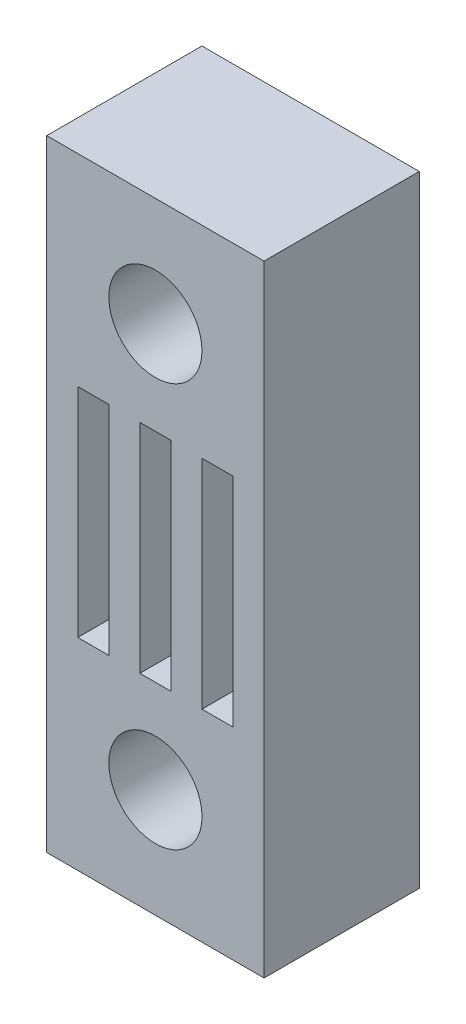
ISO-10303-21;
HEADER;
FILE_DESCRIPTION(('STEP AP214'),'2;1');
FILE_NAME('part.step','',(''),(''),'','','');
FILE_SCHEMA(('AUTOMOTIVE_DESIGN { 1 0 10303 214 1 1 1 1 }'));
ENDSEC;
DATA;
#1=APPLICATION_CONTEXT('core data for automotive mechanical design processes');
#2=APPLICATION_PROTOCOL_DEFINITION('international standard','automotive_design',2000,#1);
#3=PRODUCT_CONTEXT('',#1,'mechanical');
#4=PRODUCT('Part','Part','',(#3));
#5=PRODUCT_RELATED_PRODUCT_CATEGORY('part','',(#4));
#6=PRODUCT_DEFINITION_FORMATION('','',#4);
#7=PRODUCT_DEFINITION_CONTEXT('part definition',#1,'design');
#8=PRODUCT_DEFINITION('design','',#6,#7);
#9=PRODUCT_DEFINITION_SHAPE('','',#8);
#10=(LENGTH_UNIT() NAMED_UNIT(*) SI_UNIT(.MILLI.,.METRE.));
#11=(NAMED_UNIT(*) PLANE_ANGLE_UNIT() SI_UNIT($,.RADIAN.));
#12=(NAMED_UNIT(*) SI_UNIT($,.STERADIAN.) SOLID_ANGLE_UNIT());
#13=UNCERTAINTY_MEASURE_WITH_UNIT(LENGTH_MEASURE(1.E-05),#10,'distance_accuracy_value','');
#14=(GEOMETRIC_REPRESENTATION_CONTEXT(3) GLOBAL_UNCERTAINTY_ASSIGNED_CONTEXT((#13)) GLOBAL_UNIT_ASSIGNED_CONTEXT((#10,
#11,#12)) REPRESENTATION_CONTEXT('',''));
#15=CARTESIAN_POINT('',(0.,0.,0.));
#16=DIRECTION('',(0.,0.,1.));
#17=DIRECTION('',(1.,0.,0.));
#18=AXIS2_PLACEMENT_3D('',#15,#16,#17);
#19=CARTESIAN_POINT('',(0.,20.,5.));
#20=DIRECTION('',(0.,0.,-1.));
#21=DIRECTION('',(-1.,0.,0.));
#22=AXIS2_PLACEMENT_3D('',#19,#20,#21);
#23=PLANE('',#22);
#24=DIRECTION('',(-1.,0.,0.));
#25=VECTOR('',#24,1.);
#26=CARTESIAN_POINT('',(5.,13.5,5.));
#27=LINE('',#26,#25);
#28=CARTESIAN_POINT('',(6.,13.5,5.));
#29=VERTEX_POINT('',#28);
#30=CARTESIAN_POINT('',(5.,13.5,5.));
#31=VERTEX_POINT('',#30);
#32=EDGE_CURVE('E143',#29,#31,#27,.T.);
#33=ORIENTED_EDGE('',*,*,#32,.F.);
#34=DIRECTION('',(0.,1.,0.));
#35=VECTOR('',#34,1.);
#36=CARTESIAN_POINT('',(6.,13.5,5.));
#37=LINE('',#36,#35);
#38=CARTESIAN_POINT('',(6.,6.5,5.));
#39=VERTEX_POINT('',#38);
#40=EDGE_CURVE('E166',#39,#29,#37,.T.);
#41=ORIENTED_EDGE('',*,*,#40,.F.);
#42=DIRECTION('',(1.,0.,0.));
#43=VECTOR('',#42,1.);
#44=CARTESIAN_POINT('',(5.,6.5,5.));
#45=LINE('',#44,#43);
#46=CARTESIAN_POINT('',(5.,6.5,5.));
#47=VERTEX_POINT('',#46);
#48=EDGE_CURVE('E164',#47,#39,#45,.T.);
#49=ORIENTED_EDGE('',*,*,#48,.F.);
#50=DIRECTION('',(0.,-1.,0.));
#51=VECTOR('',#50,1.);
#52=CARTESIAN_POINT('',(5.,6.5,5.));
#53=LINE('',#52,#51);
#54=EDGE_CURVE('E151',#31,#47,#53,.T.);
#55=ORIENTED_EDGE('',*,*,#54,.F.);
#56=EDGE_LOOP('',(#33,#41,#49,#55));
#57=FACE_BOUND('',#56,.T.);
#58=DIRECTION('',(-1.,0.,0.));
#59=VECTOR('',#58,1.);
#60=CARTESIAN_POINT('',(1.,13.5,5.));
#61=LINE('',#60,#59);
#62=CARTESIAN_POINT('',(2.,13.5,5.));
#63=VERTEX_POINT('',#62);
#64=CARTESIAN_POINT('',(1.,13.5,5.));
#65=VERTEX_POINT('',#64);
#66=EDGE_CURVE('E213',#63,#65,#61,.T.);
#67=ORIENTED_EDGE('',*,*,#66,.F.);
#68=DIRECTION('',(0.,1.,0.));
#69=VECTOR('',#68,1.);
#70=CARTESIAN_POINT('',(2.,13.5,5.));
#71=LINE('',#70,#69);
#72=CARTESIAN_POINT('',(2.,6.5,5.));
#73=VERTEX_POINT('',#72);
#74=EDGE_CURVE('E221',#73,#63,#71,.T.);
#75=ORIENTED_EDGE('',*,*,#74,.F.);
#76=DIRECTION('',(1.,0.,0.));
#77=VECTOR('',#76,1.);
#78=CARTESIAN_POINT('',(1.,6.5,5.));
#79=LINE('',#78,#77);
#80=CARTESIAN_POINT('',(1.,6.5,5.));
#81=VERTEX_POINT('',#80);
#82=EDGE_CURVE('E218',#81,#73,#79,.T.);
#83=ORIENTED_EDGE('',*,*,#82,.F.);
#84=DIRECTION('',(0.,-1.,0.));
#85=VECTOR('',#84,1.);
#86=CARTESIAN_POINT('',(1.,6.5,5.));
#87=LINE('',#86,#85);
#88=EDGE_CURVE('E215',#65,#81,#87,.T.);
#89=ORIENTED_EDGE('',*,*,#88,.F.);
#90=EDGE_LOOP('',(#67,#75,#83,#89));
#91=FACE_BOUND('',#90,.T.);
#92=DIRECTION('',(0.,-1.,0.));
#93=VECTOR('',#92,1.);
#94=CARTESIAN_POINT('',(0.,0.,5.));
#95=LINE('',#94,#93);
#96=CARTESIAN_POINT('',(0.,20.,5.));
#97=VERTEX_POINT('',#96);
#98=CARTESIAN_POINT('',(0.,0.,5.));
#99=VERTEX_POINT('',#98);
#100=EDGE_CURVE('E250',#97,#99,#95,.T.);
#101=ORIENTED_EDGE('',*,*,#100,.T.);
#102=DIRECTION('',(1.,0.,0.));
#103=VECTOR('',#102,1.);
#104=CARTESIAN_POINT('',(0.,0.,5.));
#105=LINE('',#104,#103);
#106=CARTESIAN_POINT('',(7.,0.,5.));
#107=VERTEX_POINT('',#106);
#108=EDGE_CURVE('E253',#99,#107,#105,.T.);
#109=ORIENTED_EDGE('',*,*,#108,.T.);
#110=DIRECTION('',(0.,1.,0.));
#111=VECTOR('',#110,1.);
#112=CARTESIAN_POINT('',(7.,0.,5.));
#113=LINE('',#112,#111);
#114=CARTESIAN_POINT('',(6.99999999999999,20.,5.));
#115=VERTEX_POINT('',#114);
#116=EDGE_CURVE('E256',#107,#115,#113,.T.);
#117=ORIENTED_EDGE('',*,*,#116,.T.);
#118=DIRECTION('',(-1.,0.,0.));
#119=VECTOR('',#118,1.);
#120=CARTESIAN_POINT('',(0.,20.,5.));
#121=LINE('',#120,#119);
#122=EDGE_CURVE('E258',#115,#97,#121,.T.);
#123=ORIENTED_EDGE('',*,*,#122,.T.);
#124=EDGE_LOOP('',(#101,#109,#117,#123));
#125=FACE_BOUND('',#124,.T.);
#126=CARTESIAN_POINT('',(3.5,16.5,5.));
#127=DIRECTION('',(0.,0.,1.));
#128=DIRECTION('',(1.,0.,0.));
#129=AXIS2_PLACEMENT_3D('',#126,#127,#128);
#130=CIRCLE('',#129,1.5);
#131=CARTESIAN_POINT('',(5.,16.5,5.));
#132=VERTEX_POINT('',#131);
#133=EDGE_CURVE('E244',#132,#132,#130,.T.);
#134=ORIENTED_EDGE('',*,*,#133,.F.);
#135=EDGE_LOOP('',(#134));
#136=FACE_BOUND('',#135,.T.);
#137=DIRECTION('',(-1.,0.,0.));
#138=VECTOR('',#137,1.);
#139=CARTESIAN_POINT('',(3.,13.5,5.));
#140=LINE('',#139,#138);
#141=CARTESIAN_POINT('',(4.,13.5,5.));
#142=VERTEX_POINT('',#141);
#143=CARTESIAN_POINT('',(3.,13.5,5.));
#144=VERTEX_POINT('',#143);
#145=EDGE_CURVE('E182',#142,#144,#140,.T.);
#146=ORIENTED_EDGE('',*,*,#145,.F.);
#147=DIRECTION('',(0.,1.,0.));
#148=VECTOR('',#147,1.);
#149=CARTESIAN_POINT('',(4.,13.5,5.));
#150=LINE('',#149,#148);
#151=CARTESIAN_POINT('',(4.,6.5,5.));
#152=VERTEX_POINT('',#151);
#153=EDGE_CURVE('E190',#152,#142,#150,.T.);
#154=ORIENTED_EDGE('',*,*,#153,.F.);
#155=DIRECTION('',(1.,0.,0.));
#156=VECTOR('',#155,1.);
#157=CARTESIAN_POINT('',(3.,6.5,5.));
#158=LINE('',#157,#156);
#159=CARTESIAN_POINT('',(3.,6.5,5.));
#160=VERTEX_POINT('',#159);
#161=EDGE_CURVE('E187',#160,#152,#158,.T.);
#162=ORIENTED_EDGE('',*,*,#161,.F.);
#163=DIRECTION('',(0.,-1.,0.));
#164=VECTOR('',#163,1.);
#165=CARTESIAN_POINT('',(3.,6.5,5.));
#166=LINE('',#165,#164);
#167=EDGE_CURVE('E184',#144,#160,#166,.T.);
#168=ORIENTED_EDGE('',*,*,#167,.F.);
#169=EDGE_LOOP('',(#146,#154,#162,#168));
#170=FACE_BOUND('',#169,.T.);
#171=CARTESIAN_POINT('',(3.5,3.5,5.));
#172=DIRECTION('',(0.,0.,1.));
#173=DIRECTION('',(-1.,0.,0.));
#174=AXIS2_PLACEMENT_3D('',#171,#172,#173);
#175=CIRCLE('',#174,1.5);
#176=CARTESIAN_POINT('',(1.99999999999999,3.5,5.));
#177=VERTEX_POINT('',#176);
#178=EDGE_CURVE('E172',#177,#177,#175,.T.);
#179=ORIENTED_EDGE('',*,*,#178,.F.);
#180=EDGE_LOOP('',(#179));
#181=FACE_BOUND('',#180,.T.);
#182=ADVANCED_FACE('F30',(#57,#91,#125,#136,#170,#181),#23,.F.);
#183=CARTESIAN_POINT('',(0.,20.,0.));
#184=DIRECTION('',(0.,0.,-1.));
#185=DIRECTION('',(-1.,0.,0.));
#186=AXIS2_PLACEMENT_3D('',#183,#184,#185);
#187=PLANE('',#186);
#188=DIRECTION('',(0.,1.,0.));
#189=VECTOR('',#188,1.);
#190=CARTESIAN_POINT('',(6.,13.5,0.));
#191=LINE('',#190,#189);
#192=CARTESIAN_POINT('',(6.,6.5,0.));
#193=VERTEX_POINT('',#192);
#194=CARTESIAN_POINT('',(6.,13.5,0.));
#195=VERTEX_POINT('',#194);
#196=EDGE_CURVE('E152',#193,#195,#191,.T.);
#197=ORIENTED_EDGE('',*,*,#196,.T.);
#198=DIRECTION('',(-1.,0.,0.));
#199=VECTOR('',#198,1.);
#200=CARTESIAN_POINT('',(5.,13.5,0.));
#201=LINE('',#200,#199);
#202=CARTESIAN_POINT('',(5.,13.5,0.));
#203=VERTEX_POINT('',#202);
#204=EDGE_CURVE('E53',#195,#203,#201,.T.);
#205=ORIENTED_EDGE('',*,*,#204,.T.);
#206=DIRECTION('',(0.,-1.,0.));
#207=VECTOR('',#206,1.);
#208=CARTESIAN_POINT('',(5.,6.5,0.));
#209=LINE('',#208,#207);
#210=CARTESIAN_POINT('',(5.,6.5,0.));
#211=VERTEX_POINT('',#210);
#212=EDGE_CURVE('E158',#203,#211,#209,.T.);
#213=ORIENTED_EDGE('',*,*,#212,.T.);
#214=DIRECTION('',(1.,0.,0.));
#215=VECTOR('',#214,1.);
#216=CARTESIAN_POINT('',(5.,6.5,0.));
#217=LINE('',#216,#215);
#218=EDGE_CURVE('E174',#211,#193,#217,.T.);
#219=ORIENTED_EDGE('',*,*,#218,.T.);
#220=EDGE_LOOP('',(#197,#205,#213,#219));
#221=FACE_BOUND('',#220,.T.);
#222=DIRECTION('',(0.,1.,0.));
#223=VECTOR('',#222,1.);
#224=CARTESIAN_POINT('',(2.,13.5,0.));
#225=LINE('',#224,#223);
#226=CARTESIAN_POINT('',(2.,6.5,0.));
#227=VERTEX_POINT('',#226);
#228=CARTESIAN_POINT('',(2.,13.5,0.));
#229=VERTEX_POINT('',#228);
#230=EDGE_CURVE('E216',#227,#229,#225,.T.);
#231=ORIENTED_EDGE('',*,*,#230,.T.);
#232=DIRECTION('',(-1.,0.,0.));
#233=VECTOR('',#232,1.);
#234=CARTESIAN_POINT('',(1.,13.5,0.));
#235=LINE('',#234,#233);
#236=CARTESIAN_POINT('',(1.,13.5,0.));
#237=VERTEX_POINT('',#236);
#238=EDGE_CURVE('E212',#229,#237,#235,.T.);
#239=ORIENTED_EDGE('',*,*,#238,.T.);
#240=DIRECTION('',(0.,-1.,0.));
#241=VECTOR('',#240,1.);
#242=CARTESIAN_POINT('',(1.,6.5,0.));
#243=LINE('',#242,#241);
#244=CARTESIAN_POINT('',(1.,6.5,0.));
#245=VERTEX_POINT('',#244);
#246=EDGE_CURVE('E226',#237,#245,#243,.T.);
#247=ORIENTED_EDGE('',*,*,#246,.T.);
#248=DIRECTION('',(1.,0.,0.));
#249=VECTOR('',#248,1.);
#250=CARTESIAN_POINT('',(1.,6.5,0.));
#251=LINE('',#250,#249);
#252=EDGE_CURVE('E229',#245,#227,#251,.T.);
#253=ORIENTED_EDGE('',*,*,#252,.T.);
#254=EDGE_LOOP('',(#231,#239,#247,#253));
#255=FACE_BOUND('',#254,.T.);
#256=DIRECTION('',(0.,-1.,0.));
#257=VECTOR('',#256,1.);
#258=CARTESIAN_POINT('',(0.,0.,0.));
#259=LINE('',#258,#257);
#260=CARTESIAN_POINT('',(0.,20.,0.));
#261=VERTEX_POINT('',#260);
#262=CARTESIAN_POINT('',(0.,0.,0.));
#263=VERTEX_POINT('',#262);
#264=EDGE_CURVE('E247',#261,#263,#259,.T.);
#265=ORIENTED_EDGE('',*,*,#264,.F.);
#266=DIRECTION('',(-1.,0.,0.));
#267=VECTOR('',#266,1.);
#268=CARTESIAN_POINT('',(0.,20.,0.));
#269=LINE('',#268,#267);
#270=CARTESIAN_POINT('',(6.99999999999999,20.,0.));
#271=VERTEX_POINT('',#270);
#272=EDGE_CURVE('E254',#271,#261,#269,.T.);
#273=ORIENTED_EDGE('',*,*,#272,.F.);
#274=DIRECTION('',(0.,1.,0.));
#275=VECTOR('',#274,1.);
#276=CARTESIAN_POINT('',(7.,0.,0.));
#277=LINE('',#276,#275);
#278=CARTESIAN_POINT('',(7.,0.,0.));
#279=VERTEX_POINT('',#278);
#280=EDGE_CURVE('E265',#279,#271,#277,.T.);
#281=ORIENTED_EDGE('',*,*,#280,.F.);
#282=DIRECTION('',(1.,0.,0.));
#283=VECTOR('',#282,1.);
#284=CARTESIAN_POINT('',(0.,0.,0.));
#285=LINE('',#284,#283);
#286=EDGE_CURVE('E263',#263,#279,#285,.T.);
#287=ORIENTED_EDGE('',*,*,#286,.F.);
#288=EDGE_LOOP('',(#265,#273,#281,#287));
#289=FACE_BOUND('',#288,.T.);
#290=CARTESIAN_POINT('',(3.5,16.5,0.));
#291=DIRECTION('',(0.,0.,1.));
#292=DIRECTION('',(1.,0.,0.));
#293=AXIS2_PLACEMENT_3D('',#290,#291,#292);
#294=CIRCLE('',#293,1.5);
#295=CARTESIAN_POINT('',(5.,16.5,0.));
#296=VERTEX_POINT('',#295);
#297=EDGE_CURVE('E243',#296,#296,#294,.T.);
#298=ORIENTED_EDGE('',*,*,#297,.T.);
#299=EDGE_LOOP('',(#298));
#300=FACE_BOUND('',#299,.T.);
#301=DIRECTION('',(0.,1.,0.));
#302=VECTOR('',#301,1.);
#303=CARTESIAN_POINT('',(4.,13.5,0.));
#304=LINE('',#303,#302);
#305=CARTESIAN_POINT('',(4.,6.5,0.));
#306=VERTEX_POINT('',#305);
#307=CARTESIAN_POINT('',(4.,13.5,0.));
#308=VERTEX_POINT('',#307);
#309=EDGE_CURVE('E185',#306,#308,#304,.T.);
#310=ORIENTED_EDGE('',*,*,#309,.T.);
#311=DIRECTION('',(-1.,0.,0.));
#312=VECTOR('',#311,1.);
#313=CARTESIAN_POINT('',(3.,13.5,0.));
#314=LINE('',#313,#312);
#315=CARTESIAN_POINT('',(3.,13.5,0.));
#316=VERTEX_POINT('',#315);
#317=EDGE_CURVE('E159',#308,#316,#314,.T.);
#318=ORIENTED_EDGE('',*,*,#317,.T.);
#319=DIRECTION('',(0.,-1.,0.));
#320=VECTOR('',#319,1.);
#321=CARTESIAN_POINT('',(3.,6.5,0.));
#322=LINE('',#321,#320);
#323=CARTESIAN_POINT('',(3.,6.5,0.));
#324=VERTEX_POINT('',#323);
#325=EDGE_CURVE('E195',#316,#324,#322,.T.);
#326=ORIENTED_EDGE('',*,*,#325,.T.);
#327=DIRECTION('',(1.,0.,0.));
#328=VECTOR('',#327,1.);
#329=CARTESIAN_POINT('',(3.,6.5,0.));
#330=LINE('',#329,#328);
#331=EDGE_CURVE('E198',#324,#306,#330,.T.);
#332=ORIENTED_EDGE('',*,*,#331,.T.);
#333=EDGE_LOOP('',(#310,#318,#326,#332));
#334=FACE_BOUND('',#333,.T.);
#335=CARTESIAN_POINT('',(3.5,3.5,0.));
#336=DIRECTION('',(0.,0.,1.));
#337=DIRECTION('',(-1.,0.,0.));
#338=AXIS2_PLACEMENT_3D('',#335,#336,#337);
#339=CIRCLE('',#338,1.5);
#340=CARTESIAN_POINT('',(1.99999999999999,3.5,0.));
#341=VERTEX_POINT('',#340);
#342=EDGE_CURVE('E331',#341,#341,#339,.T.);
#343=ORIENTED_EDGE('',*,*,#342,.T.);
#344=EDGE_LOOP('',(#343));
#345=FACE_BOUND('',#344,.T.);
#346=ADVANCED_FACE('F283',(#221,#255,#289,#300,#334,#345),#187,.T.);
#347=CARTESIAN_POINT('',(0.,0.,5.));
#348=DIRECTION('',(1.,0.,0.));
#349=DIRECTION('',(0.,1.,0.));
#350=AXIS2_PLACEMENT_3D('',#347,#348,#349);
#351=PLANE('',#350);
#352=ORIENTED_EDGE('',*,*,#264,.T.);
#353=DIRECTION('',(0.,0.,-1.));
#354=VECTOR('',#353,1.);
#355=CARTESIAN_POINT('',(0.,0.,5.));
#356=LINE('',#355,#354);
#357=EDGE_CURVE('E11',#99,#263,#356,.T.);
#358=ORIENTED_EDGE('',*,*,#357,.F.);
#359=ORIENTED_EDGE('',*,*,#100,.F.);
#360=DIRECTION('',(0.,0.,-1.));
#361=VECTOR('',#360,1.);
#362=CARTESIAN_POINT('',(0.,20.,5.));
#363=LINE('',#362,#361);
#364=EDGE_CURVE('E260',#97,#261,#363,.T.);
#365=ORIENTED_EDGE('',*,*,#364,.T.);
#366=EDGE_LOOP('',(#352,#358,#359,#365));
#367=FACE_BOUND('',#366,.T.);
#368=ADVANCED_FACE('F32',(#367),#351,.F.);
#369=CARTESIAN_POINT('',(0.,0.,5.));
#370=DIRECTION('',(0.,1.,0.));
#371=DIRECTION('',(0.,0.,1.));
#372=AXIS2_PLACEMENT_3D('',#369,#370,#371);
#373=PLANE('',#372);
#374=ORIENTED_EDGE('',*,*,#286,.T.);
#375=DIRECTION('',(0.,0.,-1.));
#376=VECTOR('',#375,1.);
#377=CARTESIAN_POINT('',(7.,0.,5.));
#378=LINE('',#377,#376);
#379=EDGE_CURVE('E38',#107,#279,#378,.T.);
#380=ORIENTED_EDGE('',*,*,#379,.F.);
#381=ORIENTED_EDGE('',*,*,#108,.F.);
#382=ORIENTED_EDGE('',*,*,#357,.T.);
#383=EDGE_LOOP('',(#374,#380,#381,#382));
#384=FACE_BOUND('',#383,.T.);
#385=ADVANCED_FACE('F294',(#384),#373,.F.);
#386=CARTESIAN_POINT('',(7.,0.,5.));
#387=DIRECTION('',(-1.,0.,0.));
#388=DIRECTION('',(0.,-1.,0.));
#389=AXIS2_PLACEMENT_3D('',#386,#387,#388);
#390=PLANE('',#389);
#391=ORIENTED_EDGE('',*,*,#280,.T.);
#392=DIRECTION('',(0.,0.,-1.));
#393=VECTOR('',#392,1.);
#394=CARTESIAN_POINT('',(6.99999999999999,20.,5.));
#395=LINE('',#394,#393);
#396=EDGE_CURVE('E270',#115,#271,#395,.T.);
#397=ORIENTED_EDGE('',*,*,#396,.F.);
#398=ORIENTED_EDGE('',*,*,#116,.F.);
#399=ORIENTED_EDGE('',*,*,#379,.T.);
#400=EDGE_LOOP('',(#391,#397,#398,#399));
#401=FACE_BOUND('',#400,.T.);
#402=ADVANCED_FACE('F277',(#401),#390,.F.);
#403=CARTESIAN_POINT('',(0.,20.,5.));
#404=DIRECTION('',(0.,-1.,0.));
#405=DIRECTION('',(0.,0.,-1.));
#406=AXIS2_PLACEMENT_3D('',#403,#404,#405);
#407=PLANE('',#406);
#408=ORIENTED_EDGE('',*,*,#272,.T.);
#409=ORIENTED_EDGE('',*,*,#364,.F.);
#410=ORIENTED_EDGE('',*,*,#122,.F.);
#411=ORIENTED_EDGE('',*,*,#396,.T.);
#412=EDGE_LOOP('',(#408,#409,#410,#411));
#413=FACE_BOUND('',#412,.T.);
#414=ADVANCED_FACE('F287',(#413),#407,.F.);
#415=CARTESIAN_POINT('',(3.5,16.5,5.));
#416=DIRECTION('',(0.,0.,-1.));
#417=DIRECTION('',(-1.,0.,0.));
#418=AXIS2_PLACEMENT_3D('',#415,#416,#417);
#419=CYLINDRICAL_SURFACE('',#418,1.5);
#420=ORIENTED_EDGE('',*,*,#133,.T.);
#421=EDGE_LOOP('',(#420));
#422=FACE_BOUND('',#421,.T.);
#423=ORIENTED_EDGE('',*,*,#297,.F.);
#424=EDGE_LOOP('',(#423));
#425=FACE_BOUND('',#424,.T.);
#426=ADVANCED_FACE('F309',(#422,#425),#419,.F.);
#427=CARTESIAN_POINT('',(1.,13.5,5.));
#428=DIRECTION('',(0.,-1.,0.));
#429=DIRECTION('',(0.,0.,-1.));
#430=AXIS2_PLACEMENT_3D('',#427,#428,#429);
#431=PLANE('',#430);
#432=ORIENTED_EDGE('',*,*,#238,.F.);
#433=DIRECTION('',(0.,0.,-1.));
#434=VECTOR('',#433,1.);
#435=CARTESIAN_POINT('',(2.,13.5,5.));
#436=LINE('',#435,#434);
#437=EDGE_CURVE('E223',#63,#229,#436,.T.);
#438=ORIENTED_EDGE('',*,*,#437,.F.);
#439=ORIENTED_EDGE('',*,*,#66,.T.);
#440=DIRECTION('',(0.,0.,-1.));
#441=VECTOR('',#440,1.);
#442=CARTESIAN_POINT('',(1.,13.5,5.));
#443=LINE('',#442,#441);
#444=EDGE_CURVE('E240',#65,#237,#443,.T.);
#445=ORIENTED_EDGE('',*,*,#444,.T.);
#446=EDGE_LOOP('',(#432,#438,#439,#445));
#447=FACE_BOUND('',#446,.T.);
#448=ADVANCED_FACE('F316',(#447),#431,.T.);
#449=CARTESIAN_POINT('',(1.,6.5,5.));
#450=DIRECTION('',(1.,0.,0.));
#451=DIRECTION('',(0.,0.,-1.));
#452=AXIS2_PLACEMENT_3D('',#449,#450,#451);
#453=PLANE('',#452);
#454=ORIENTED_EDGE('',*,*,#246,.F.);
#455=ORIENTED_EDGE('',*,*,#444,.F.);
#456=ORIENTED_EDGE('',*,*,#88,.T.);
#457=DIRECTION('',(0.,0.,-1.));
#458=VECTOR('',#457,1.);
#459=CARTESIAN_POINT('',(1.,6.5,5.));
#460=LINE('',#459,#458);
#461=EDGE_CURVE('E238',#81,#245,#460,.T.);
#462=ORIENTED_EDGE('',*,*,#461,.T.);
#463=EDGE_LOOP('',(#454,#455,#456,#462));
#464=FACE_BOUND('',#463,.T.);
#465=ADVANCED_FACE('F321',(#464),#453,.T.);
#466=CARTESIAN_POINT('',(1.,6.5,5.));
#467=DIRECTION('',(0.,1.,0.));
#468=DIRECTION('',(0.,0.,1.));
#469=AXIS2_PLACEMENT_3D('',#466,#467,#468);
#470=PLANE('',#469);
#471=ORIENTED_EDGE('',*,*,#252,.F.);
#472=ORIENTED_EDGE('',*,*,#461,.F.);
#473=ORIENTED_EDGE('',*,*,#82,.T.);
#474=DIRECTION('',(0.,0.,-1.));
#475=VECTOR('',#474,1.);
#476=CARTESIAN_POINT('',(2.,6.5,5.));
#477=LINE('',#476,#475);
#478=EDGE_CURVE('E236',#73,#227,#477,.T.);
#479=ORIENTED_EDGE('',*,*,#478,.T.);
#480=EDGE_LOOP('',(#471,#472,#473,#479));
#481=FACE_BOUND('',#480,.T.);
#482=ADVANCED_FACE('F374',(#481),#470,.T.);
#483=CARTESIAN_POINT('',(2.,13.5,5.));
#484=DIRECTION('',(-1.,0.,0.));
#485=DIRECTION('',(0.,0.,1.));
#486=AXIS2_PLACEMENT_3D('',#483,#484,#485);
#487=PLANE('',#486);
#488=ORIENTED_EDGE('',*,*,#230,.F.);
#489=ORIENTED_EDGE('',*,*,#478,.F.);
#490=ORIENTED_EDGE('',*,*,#74,.T.);
#491=ORIENTED_EDGE('',*,*,#437,.T.);
#492=EDGE_LOOP('',(#488,#489,#490,#491));
#493=FACE_BOUND('',#492,.T.);
#494=ADVANCED_FACE('F370',(#493),#487,.T.);
#495=CARTESIAN_POINT('',(3.,13.5,5.));
#496=DIRECTION('',(0.,-1.,0.));
#497=DIRECTION('',(0.,0.,-1.));
#498=AXIS2_PLACEMENT_3D('',#495,#496,#497);
#499=PLANE('',#498);
#500=ORIENTED_EDGE('',*,*,#317,.F.);
#501=DIRECTION('',(0.,0.,-1.));
#502=VECTOR('',#501,1.);
#503=CARTESIAN_POINT('',(4.,13.5,5.));
#504=LINE('',#503,#502);
#505=EDGE_CURVE('E192',#142,#308,#504,.T.);
#506=ORIENTED_EDGE('',*,*,#505,.F.);
#507=ORIENTED_EDGE('',*,*,#145,.T.);
#508=DIRECTION('',(0.,0.,-1.));
#509=VECTOR('',#508,1.);
#510=CARTESIAN_POINT('',(3.,13.5,5.));
#511=LINE('',#510,#509);
#512=EDGE_CURVE('E209',#144,#316,#511,.T.);
#513=ORIENTED_EDGE('',*,*,#512,.T.);
#514=EDGE_LOOP('',(#500,#506,#507,#513));
#515=FACE_BOUND('',#514,.T.);
#516=ADVANCED_FACE('F366',(#515),#499,.T.);
#517=CARTESIAN_POINT('',(3.,6.5,5.));
#518=DIRECTION('',(1.,0.,0.));
#519=DIRECTION('',(0.,0.,-1.));
#520=AXIS2_PLACEMENT_3D('',#517,#518,#519);
#521=PLANE('',#520);
#522=ORIENTED_EDGE('',*,*,#325,.F.);
#523=ORIENTED_EDGE('',*,*,#512,.F.);
#524=ORIENTED_EDGE('',*,*,#167,.T.);
#525=DIRECTION('',(0.,0.,-1.));
#526=VECTOR('',#525,1.);
#527=CARTESIAN_POINT('',(3.,6.5,5.));
#528=LINE('',#527,#526);
#529=EDGE_CURVE('E207',#160,#324,#528,.T.);
#530=ORIENTED_EDGE('',*,*,#529,.T.);
#531=EDGE_LOOP('',(#522,#523,#524,#530));
#532=FACE_BOUND('',#531,.T.);
#533=ADVANCED_FACE('F362',(#532),#521,.T.);
#534=CARTESIAN_POINT('',(3.,6.5,5.));
#535=DIRECTION('',(0.,1.,0.));
#536=DIRECTION('',(0.,0.,1.));
#537=AXIS2_PLACEMENT_3D('',#534,#535,#536);
#538=PLANE('',#537);
#539=ORIENTED_EDGE('',*,*,#331,.F.);
#540=ORIENTED_EDGE('',*,*,#529,.F.);
#541=ORIENTED_EDGE('',*,*,#161,.T.);
#542=DIRECTION('',(0.,0.,-1.));
#543=VECTOR('',#542,1.);
#544=CARTESIAN_POINT('',(4.,6.5,5.));
#545=LINE('',#544,#543);
#546=EDGE_CURVE('E205',#152,#306,#545,.T.);
#547=ORIENTED_EDGE('',*,*,#546,.T.);
#548=EDGE_LOOP('',(#539,#540,#541,#547));
#549=FACE_BOUND('',#548,.T.);
#550=ADVANCED_FACE('F358',(#549),#538,.T.);
#551=CARTESIAN_POINT('',(4.,13.5,5.));
#552=DIRECTION('',(-1.,0.,0.));
#553=DIRECTION('',(0.,0.,1.));
#554=AXIS2_PLACEMENT_3D('',#551,#552,#553);
#555=PLANE('',#554);
#556=ORIENTED_EDGE('',*,*,#309,.F.);
#557=ORIENTED_EDGE('',*,*,#546,.F.);
#558=ORIENTED_EDGE('',*,*,#153,.T.);
#559=ORIENTED_EDGE('',*,*,#505,.T.);
#560=EDGE_LOOP('',(#556,#557,#558,#559));
#561=FACE_BOUND('',#560,.T.);
#562=ADVANCED_FACE('F355',(#561),#555,.T.);
#563=CARTESIAN_POINT('',(5.,13.5,5.));
#564=DIRECTION('',(0.,-1.,0.));
#565=DIRECTION('',(0.,0.,-1.));
#566=AXIS2_PLACEMENT_3D('',#563,#564,#565);
#567=PLANE('',#566);
#568=ORIENTED_EDGE('',*,*,#204,.F.);
#569=DIRECTION('',(0.,0.,-1.));
#570=VECTOR('',#569,1.);
#571=CARTESIAN_POINT('',(6.,13.5,5.));
#572=LINE('',#571,#570);
#573=EDGE_CURVE('E147',#29,#195,#572,.T.);
#574=ORIENTED_EDGE('',*,*,#573,.F.);
#575=ORIENTED_EDGE('',*,*,#32,.T.);
#576=DIRECTION('',(0.,0.,-1.));
#577=VECTOR('',#576,1.);
#578=CARTESIAN_POINT('',(5.,13.5,5.));
#579=LINE('',#578,#577);
#580=EDGE_CURVE('E146',#31,#203,#579,.T.);
#581=ORIENTED_EDGE('',*,*,#580,.T.);
#582=EDGE_LOOP('',(#568,#574,#575,#581));
#583=FACE_BOUND('',#582,.T.);
#584=ADVANCED_FACE('F145',(#583),#567,.T.);
#585=CARTESIAN_POINT('',(5.,6.5,5.));
#586=DIRECTION('',(1.,0.,0.));
#587=DIRECTION('',(0.,0.,-1.));
#588=AXIS2_PLACEMENT_3D('',#585,#586,#587);
#589=PLANE('',#588);
#590=ORIENTED_EDGE('',*,*,#212,.F.);
#591=ORIENTED_EDGE('',*,*,#580,.F.);
#592=ORIENTED_EDGE('',*,*,#54,.T.);
#593=DIRECTION('',(0.,0.,-1.));
#594=VECTOR('',#593,1.);
#595=CARTESIAN_POINT('',(5.,6.5,5.));
#596=LINE('',#595,#594);
#597=EDGE_CURVE('E160',#47,#211,#596,.T.);
#598=ORIENTED_EDGE('',*,*,#597,.T.);
#599=EDGE_LOOP('',(#590,#591,#592,#598));
#600=FACE_BOUND('',#599,.T.);
#601=ADVANCED_FACE('F155',(#600),#589,.T.);
#602=CARTESIAN_POINT('',(5.,6.5,5.));
#603=DIRECTION('',(0.,1.,0.));
#604=DIRECTION('',(0.,0.,1.));
#605=AXIS2_PLACEMENT_3D('',#602,#603,#604);
#606=PLANE('',#605);
#607=ORIENTED_EDGE('',*,*,#218,.F.);
#608=ORIENTED_EDGE('',*,*,#597,.F.);
#609=ORIENTED_EDGE('',*,*,#48,.T.);
#610=DIRECTION('',(0.,0.,-1.));
#611=VECTOR('',#610,1.);
#612=CARTESIAN_POINT('',(6.,6.5,5.));
#613=LINE('',#612,#611);
#614=EDGE_CURVE('E45',#39,#193,#613,.T.);
#615=ORIENTED_EDGE('',*,*,#614,.T.);
#616=EDGE_LOOP('',(#607,#608,#609,#615));
#617=FACE_BOUND('',#616,.T.);
#618=ADVANCED_FACE('F345',(#617),#606,.T.);
#619=CARTESIAN_POINT('',(6.,13.5,5.));
#620=DIRECTION('',(-1.,0.,0.));
#621=DIRECTION('',(0.,0.,1.));
#622=AXIS2_PLACEMENT_3D('',#619,#620,#621);
#623=PLANE('',#622);
#624=ORIENTED_EDGE('',*,*,#196,.F.);
#625=ORIENTED_EDGE('',*,*,#614,.F.);
#626=ORIENTED_EDGE('',*,*,#40,.T.);
#627=ORIENTED_EDGE('',*,*,#573,.T.);
#628=EDGE_LOOP('',(#624,#625,#626,#627));
#629=FACE_BOUND('',#628,.T.);
#630=ADVANCED_FACE('F340',(#629),#623,.T.);
#631=CARTESIAN_POINT('',(3.5,3.5,5.));
#632=DIRECTION('',(0.,0.,-1.));
#633=DIRECTION('',(-1.,0.,0.));
#634=AXIS2_PLACEMENT_3D('',#631,#632,#633);
#635=CYLINDRICAL_SURFACE('',#634,1.5);
#636=ORIENTED_EDGE('',*,*,#178,.T.);
#637=EDGE_LOOP('',(#636));
#638=FACE_BOUND('',#637,.T.);
#639=ORIENTED_EDGE('',*,*,#342,.F.);
#640=EDGE_LOOP('',(#639));
#641=FACE_BOUND('',#640,.T.);
#642=ADVANCED_FACE('F337',(#638,#641),#635,.F.);
#643=CLOSED_SHELL('',(#182,#346,#368,#385,#402,#414,#426,#448,#465,#482,#494,#516,#533,#550,
#562,#584,#601,#618,#630,#642));
#644=MANIFOLD_SOLID_BREP('B2',#643);
#645=ADVANCED_BREP_SHAPE_REPRESENTATION('',(#18,#644),#14);
#646=SHAPE_DEFINITION_REPRESENTATION(#9,#645);
ENDSEC;
END-ISO-10303-21;
